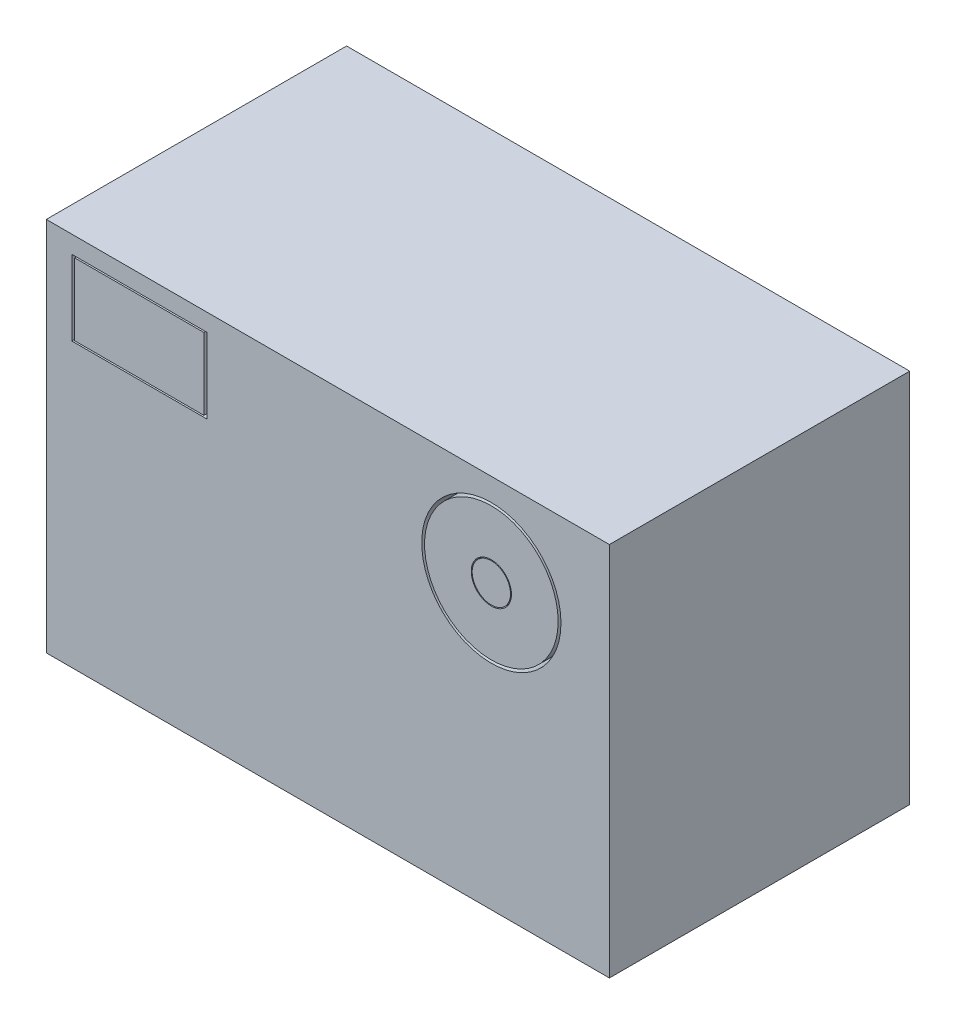
ISO-10303-21;
HEADER;
FILE_DESCRIPTION(('STEP AP214'),'2;1');
FILE_NAME('part.step','',(''),(''),'','','');
FILE_SCHEMA(('AUTOMOTIVE_DESIGN { 1 0 10303 214 1 1 1 1 }'));
ENDSEC;
DATA;
#1=APPLICATION_CONTEXT('core data for automotive mechanical design processes');
#2=APPLICATION_PROTOCOL_DEFINITION('international standard','automotive_design',2000,#1);
#3=PRODUCT_CONTEXT('',#1,'mechanical');
#4=PRODUCT('Part','Part','',(#3));
#5=PRODUCT_RELATED_PRODUCT_CATEGORY('part','',(#4));
#6=PRODUCT_DEFINITION_FORMATION('','',#4);
#7=PRODUCT_DEFINITION_CONTEXT('part definition',#1,'design');
#8=PRODUCT_DEFINITION('design','',#6,#7);
#9=PRODUCT_DEFINITION_SHAPE('','',#8);
#10=(LENGTH_UNIT() NAMED_UNIT(*) SI_UNIT(.MILLI.,.METRE.));
#11=(NAMED_UNIT(*) PLANE_ANGLE_UNIT() SI_UNIT($,.RADIAN.));
#12=(NAMED_UNIT(*) SI_UNIT($,.STERADIAN.) SOLID_ANGLE_UNIT());
#13=UNCERTAINTY_MEASURE_WITH_UNIT(LENGTH_MEASURE(1.E-05),#10,'distance_accuracy_value','');
#14=(GEOMETRIC_REPRESENTATION_CONTEXT(3) GLOBAL_UNCERTAINTY_ASSIGNED_CONTEXT((#13)) GLOBAL_UNIT_ASSIGNED_CONTEXT((#10,
#11,#12)) REPRESENTATION_CONTEXT('',''));
#15=CARTESIAN_POINT('',(0.,0.,0.));
#16=DIRECTION('',(0.,0.,1.));
#17=DIRECTION('',(1.,0.,0.));
#18=AXIS2_PLACEMENT_3D('',#15,#16,#17);
#19=CARTESIAN_POINT('',(37.5,25.,40.));
#20=DIRECTION('',(-1.,0.,0.));
#21=DIRECTION('',(0.,-1.,0.));
#22=AXIS2_PLACEMENT_3D('',#19,#20,#21);
#23=PLANE('',#22);
#24=DIRECTION('',(0.,1.,0.));
#25=VECTOR('',#24,1.);
#26=CARTESIAN_POINT('',(37.5,25.,0.));
#27=LINE('',#26,#25);
#28=CARTESIAN_POINT('',(37.5,-25.,0.));
#29=VERTEX_POINT('',#28);
#30=CARTESIAN_POINT('',(37.5,25.,0.));
#31=VERTEX_POINT('',#30);
#32=EDGE_CURVE('E216',#29,#31,#27,.T.);
#33=ORIENTED_EDGE('',*,*,#32,.T.);
#34=DIRECTION('',(0.,0.,-1.));
#35=VECTOR('',#34,1.);
#36=CARTESIAN_POINT('',(37.5,25.,40.));
#37=LINE('',#36,#35);
#38=CARTESIAN_POINT('',(37.5,25.,40.));
#39=VERTEX_POINT('',#38);
#40=EDGE_CURVE('E41',#39,#31,#37,.T.);
#41=ORIENTED_EDGE('',*,*,#40,.F.);
#42=DIRECTION('',(0.,1.,0.));
#43=VECTOR('',#42,1.);
#44=CARTESIAN_POINT('',(37.5,25.,40.));
#45=LINE('',#44,#43);
#46=CARTESIAN_POINT('',(37.5,-25.,40.));
#47=VERTEX_POINT('',#46);
#48=EDGE_CURVE('E219',#47,#39,#45,.T.);
#49=ORIENTED_EDGE('',*,*,#48,.F.);
#50=DIRECTION('',(0.,0.,-1.));
#51=VECTOR('',#50,1.);
#52=CARTESIAN_POINT('',(37.5,-25.,40.));
#53=LINE('',#52,#51);
#54=EDGE_CURVE('E229',#47,#29,#53,.T.);
#55=ORIENTED_EDGE('',*,*,#54,.T.);
#56=EDGE_LOOP('',(#33,#41,#49,#55));
#57=FACE_BOUND('',#56,.T.);
#58=ADVANCED_FACE('F34',(#57),#23,.F.);
#59=CARTESIAN_POINT('',(-37.5,25.,40.));
#60=DIRECTION('',(0.,-1.,0.));
#61=DIRECTION('',(0.,0.,-1.));
#62=AXIS2_PLACEMENT_3D('',#59,#60,#61);
#63=PLANE('',#62);
#64=DIRECTION('',(-1.,0.,0.));
#65=VECTOR('',#64,1.);
#66=CARTESIAN_POINT('',(-37.5,25.,0.));
#67=LINE('',#66,#65);
#68=CARTESIAN_POINT('',(-37.5,25.,0.));
#69=VERTEX_POINT('',#68);
#70=EDGE_CURVE('E232',#31,#69,#67,.T.);
#71=ORIENTED_EDGE('',*,*,#70,.T.);
#72=DIRECTION('',(0.,0.,-1.));
#73=VECTOR('',#72,1.);
#74=CARTESIAN_POINT('',(-37.5,25.,40.));
#75=LINE('',#74,#73);
#76=CARTESIAN_POINT('',(-37.5,25.,40.));
#77=VERTEX_POINT('',#76);
#78=EDGE_CURVE('E242',#77,#69,#75,.T.);
#79=ORIENTED_EDGE('',*,*,#78,.F.);
#80=DIRECTION('',(-1.,0.,0.));
#81=VECTOR('',#80,1.);
#82=CARTESIAN_POINT('',(-37.5,25.,40.));
#83=LINE('',#82,#81);
#84=EDGE_CURVE('E222',#39,#77,#83,.T.);
#85=ORIENTED_EDGE('',*,*,#84,.F.);
#86=ORIENTED_EDGE('',*,*,#40,.T.);
#87=EDGE_LOOP('',(#71,#79,#85,#86));
#88=FACE_BOUND('',#87,.T.);
#89=ADVANCED_FACE('F247',(#88),#63,.F.);
#90=CARTESIAN_POINT('',(-37.5,25.,40.));
#91=DIRECTION('',(1.,0.,0.));
#92=DIRECTION('',(0.,1.,0.));
#93=AXIS2_PLACEMENT_3D('',#90,#91,#92);
#94=PLANE('',#93);
#95=DIRECTION('',(0.,-1.,0.));
#96=VECTOR('',#95,1.);
#97=CARTESIAN_POINT('',(-37.5,25.,0.));
#98=LINE('',#97,#96);
#99=CARTESIAN_POINT('',(-37.5,-25.,0.));
#100=VERTEX_POINT('',#99);
#101=EDGE_CURVE('E234',#69,#100,#98,.T.);
#102=ORIENTED_EDGE('',*,*,#101,.T.);
#103=DIRECTION('',(0.,0.,-1.));
#104=VECTOR('',#103,1.);
#105=CARTESIAN_POINT('',(-37.5,-25.,40.));
#106=LINE('',#105,#104);
#107=CARTESIAN_POINT('',(-37.5,-25.,40.));
#108=VERTEX_POINT('',#107);
#109=EDGE_CURVE('E239',#108,#100,#106,.T.);
#110=ORIENTED_EDGE('',*,*,#109,.F.);
#111=DIRECTION('',(0.,-1.,0.));
#112=VECTOR('',#111,1.);
#113=CARTESIAN_POINT('',(-37.5,25.,40.));
#114=LINE('',#113,#112);
#115=EDGE_CURVE('E225',#77,#108,#114,.T.);
#116=ORIENTED_EDGE('',*,*,#115,.F.);
#117=ORIENTED_EDGE('',*,*,#78,.T.);
#118=EDGE_LOOP('',(#102,#110,#116,#117));
#119=FACE_BOUND('',#118,.T.);
#120=ADVANCED_FACE('F259',(#119),#94,.F.);
#121=CARTESIAN_POINT('',(-37.5,-25.,40.));
#122=DIRECTION('',(0.,1.,0.));
#123=DIRECTION('',(0.,0.,1.));
#124=AXIS2_PLACEMENT_3D('',#121,#122,#123);
#125=PLANE('',#124);
#126=CARTESIAN_POINT('',(0.,-25.,20.));
#127=DIRECTION('',(0.,-1.,0.));
#128=DIRECTION('',(0.,0.,-1.));
#129=AXIS2_PLACEMENT_3D('',#126,#127,#128);
#130=CIRCLE('',#129,5.);
#131=CARTESIAN_POINT('',(0.,-25.,15.));
#132=VERTEX_POINT('',#131);
#133=EDGE_CURVE('E153',#132,#132,#130,.T.);
#134=ORIENTED_EDGE('',*,*,#133,.F.);
#135=EDGE_LOOP('',(#134));
#136=FACE_BOUND('',#135,.T.);
#137=DIRECTION('',(1.,0.,0.));
#138=VECTOR('',#137,1.);
#139=CARTESIAN_POINT('',(-37.5,-25.,0.));
#140=LINE('',#139,#138);
#141=EDGE_CURVE('E223',#100,#29,#140,.T.);
#142=ORIENTED_EDGE('',*,*,#141,.T.);
#143=ORIENTED_EDGE('',*,*,#54,.F.);
#144=DIRECTION('',(1.,0.,0.));
#145=VECTOR('',#144,1.);
#146=CARTESIAN_POINT('',(-37.5,-25.,40.));
#147=LINE('',#146,#145);
#148=EDGE_CURVE('E227',#108,#47,#147,.T.);
#149=ORIENTED_EDGE('',*,*,#148,.F.);
#150=ORIENTED_EDGE('',*,*,#109,.T.);
#151=EDGE_LOOP('',(#142,#143,#149,#150));
#152=FACE_BOUND('',#151,.T.);
#153=ADVANCED_FACE('F263',(#136,#152),#125,.F.);
#154=CARTESIAN_POINT('',(0.,0.,40.));
#155=DIRECTION('',(0.,0.,1.));
#156=DIRECTION('',(1.,0.,0.));
#157=AXIS2_PLACEMENT_3D('',#154,#155,#156);
#158=PLANE('',#157);
#159=DIRECTION('',(0.,1.,0.));
#160=VECTOR('',#159,1.);
#161=CARTESIAN_POINT('',(-16.1069269045162,12.6743621328923,40.));
#162=LINE('',#161,#160);
#163=CARTESIAN_POINT('',(-16.1069269045162,12.6743621328923,40.));
#164=VERTEX_POINT('',#163);
#165=CARTESIAN_POINT('',(-16.1069269045162,22.6743621328923,40.));
#166=VERTEX_POINT('',#165);
#167=EDGE_CURVE('E48',#164,#166,#162,.T.);
#168=ORIENTED_EDGE('',*,*,#167,.F.);
#169=DIRECTION('',(1.,0.,0.));
#170=VECTOR('',#169,1.);
#171=CARTESIAN_POINT('',(-34.1069269045162,12.6743621328923,40.));
#172=LINE('',#171,#170);
#173=CARTESIAN_POINT('',(-34.1069269045162,12.6743621328923,40.));
#174=VERTEX_POINT('',#173);
#175=EDGE_CURVE('E171',#174,#164,#172,.T.);
#176=ORIENTED_EDGE('',*,*,#175,.F.);
#177=DIRECTION('',(0.,-1.,0.));
#178=VECTOR('',#177,1.);
#179=CARTESIAN_POINT('',(-34.1069269045162,12.6743621328923,40.));
#180=LINE('',#179,#178);
#181=CARTESIAN_POINT('',(-34.1069269045162,22.6743621328923,40.));
#182=VERTEX_POINT('',#181);
#183=EDGE_CURVE('E185',#182,#174,#180,.T.);
#184=ORIENTED_EDGE('',*,*,#183,.F.);
#185=DIRECTION('',(-1.,0.,0.));
#186=VECTOR('',#185,1.);
#187=CARTESIAN_POINT('',(-34.1069269045162,22.6743621328923,40.));
#188=LINE('',#187,#186);
#189=EDGE_CURVE('E182',#166,#182,#188,.T.);
#190=ORIENTED_EDGE('',*,*,#189,.F.);
#191=EDGE_LOOP('',(#168,#176,#184,#190));
#192=FACE_BOUND('',#191,.T.);
#193=CARTESIAN_POINT('',(21.7781929220404,12.7140846947109,40.));
#194=DIRECTION('',(0.,0.,1.));
#195=DIRECTION('',(1.,0.,0.));
#196=AXIS2_PLACEMENT_3D('',#193,#194,#195);
#197=CIRCLE('',#196,9.27298373328783);
#198=CARTESIAN_POINT('',(31.0511766553282,12.7140846947109,40.));
#199=VERTEX_POINT('',#198);
#200=EDGE_CURVE('E210',#199,#199,#197,.T.);
#201=ORIENTED_EDGE('',*,*,#200,.F.);
#202=EDGE_LOOP('',(#201));
#203=FACE_BOUND('',#202,.T.);
#204=ORIENTED_EDGE('',*,*,#48,.T.);
#205=ORIENTED_EDGE('',*,*,#84,.T.);
#206=ORIENTED_EDGE('',*,*,#115,.T.);
#207=ORIENTED_EDGE('',*,*,#148,.T.);
#208=EDGE_LOOP('',(#204,#205,#206,#207));
#209=FACE_BOUND('',#208,.T.);
#210=ADVANCED_FACE('F265',(#192,#203,#209),#158,.T.);
#211=CARTESIAN_POINT('',(0.,0.,0.));
#212=DIRECTION('',(0.,0.,1.));
#213=DIRECTION('',(1.,0.,0.));
#214=AXIS2_PLACEMENT_3D('',#211,#212,#213);
#215=PLANE('',#214);
#216=ORIENTED_EDGE('',*,*,#32,.F.);
#217=ORIENTED_EDGE('',*,*,#141,.F.);
#218=ORIENTED_EDGE('',*,*,#101,.F.);
#219=ORIENTED_EDGE('',*,*,#70,.F.);
#220=EDGE_LOOP('',(#216,#217,#218,#219));
#221=FACE_BOUND('',#220,.T.);
#222=ADVANCED_FACE('F255',(#221),#215,.F.);
#223=CARTESIAN_POINT('',(21.7781929220404,12.7140846947109,26.));
#224=DIRECTION('',(0.,0.,1.));
#225=DIRECTION('',(1.,0.,0.));
#226=AXIS2_PLACEMENT_3D('',#223,#224,#225);
#227=CYLINDRICAL_SURFACE('',#226,9.27298373328783);
#228=CARTESIAN_POINT('',(21.7781929220404,12.7140846947109,26.));
#229=DIRECTION('',(0.,0.,1.));
#230=DIRECTION('',(1.,0.,0.));
#231=AXIS2_PLACEMENT_3D('',#228,#229,#230);
#232=CIRCLE('',#231,9.27298373328783);
#233=CARTESIAN_POINT('',(31.0511766553282,12.7140846947109,26.));
#234=VERTEX_POINT('',#233);
#235=EDGE_CURVE('E213',#234,#234,#232,.T.);
#236=ORIENTED_EDGE('',*,*,#235,.F.);
#237=EDGE_LOOP('',(#236));
#238=FACE_BOUND('',#237,.T.);
#239=ORIENTED_EDGE('',*,*,#200,.T.);
#240=EDGE_LOOP('',(#239));
#241=FACE_BOUND('',#240,.T.);
#242=ADVANCED_FACE('F274',(#238,#241),#227,.F.);
#243=CARTESIAN_POINT('',(21.7781929220404,12.7140846947109,26.));
#244=DIRECTION('',(0.,0.,1.));
#245=DIRECTION('',(1.,0.,0.));
#246=AXIS2_PLACEMENT_3D('',#243,#244,#245);
#247=PLANE('',#246);
#248=CARTESIAN_POINT('',(21.7781929220404,12.7140846947109,26.));
#249=DIRECTION('',(0.,0.,1.));
#250=DIRECTION('',(1.,0.,0.));
#251=AXIS2_PLACEMENT_3D('',#248,#249,#250);
#252=CIRCLE('',#251,8.89567309489849);
#253=CARTESIAN_POINT('',(30.6738660169389,12.7140846947109,26.));
#254=VERTEX_POINT('',#253);
#255=EDGE_CURVE('E206',#254,#254,#252,.T.);
#256=ORIENTED_EDGE('',*,*,#255,.F.);
#257=EDGE_LOOP('',(#256));
#258=FACE_BOUND('',#257,.T.);
#259=ORIENTED_EDGE('',*,*,#235,.T.);
#260=EDGE_LOOP('',(#259));
#261=FACE_BOUND('',#260,.T.);
#262=ADVANCED_FACE('F375',(#258,#261),#247,.T.);
#263=CARTESIAN_POINT('',(21.7781929220404,12.7140846947109,40.));
#264=DIRECTION('',(0.,0.,1.));
#265=DIRECTION('',(1.,0.,0.));
#266=AXIS2_PLACEMENT_3D('',#263,#264,#265);
#267=PLANE('',#266);
#268=CARTESIAN_POINT('',(21.7781929220404,12.7140846947109,40.));
#269=DIRECTION('',(0.,0.,1.));
#270=DIRECTION('',(1.,0.,0.));
#271=AXIS2_PLACEMENT_3D('',#268,#269,#270);
#272=CIRCLE('',#271,8.89567309489849);
#273=CARTESIAN_POINT('',(30.6738660169389,12.7140846947109,40.));
#274=VERTEX_POINT('',#273);
#275=EDGE_CURVE('E207',#274,#274,#272,.T.);
#276=ORIENTED_EDGE('',*,*,#275,.T.);
#277=EDGE_LOOP('',(#276));
#278=FACE_BOUND('',#277,.T.);
#279=CARTESIAN_POINT('',(21.7781929220404,12.7140846947109,40.));
#280=DIRECTION('',(0.,0.,1.));
#281=DIRECTION('',(1.,0.,0.));
#282=AXIS2_PLACEMENT_3D('',#279,#280,#281);
#283=CIRCLE('',#282,2.67664940941278);
#284=CARTESIAN_POINT('',(24.4548423314532,12.7140846947109,40.));
#285=VERTEX_POINT('',#284);
#286=EDGE_CURVE('E201',#285,#285,#283,.T.);
#287=ORIENTED_EDGE('',*,*,#286,.F.);
#288=EDGE_LOOP('',(#287));
#289=FACE_BOUND('',#288,.T.);
#290=ADVANCED_FACE('F372',(#278,#289),#267,.T.);
#291=CARTESIAN_POINT('',(21.7781929220404,12.7140846947109,40.));
#292=DIRECTION('',(0.,0.,-1.));
#293=DIRECTION('',(-1.,0.,0.));
#294=AXIS2_PLACEMENT_3D('',#291,#292,#293);
#295=CYLINDRICAL_SURFACE('',#294,8.89567309489849);
#296=ORIENTED_EDGE('',*,*,#275,.F.);
#297=EDGE_LOOP('',(#296));
#298=FACE_BOUND('',#297,.T.);
#299=ORIENTED_EDGE('',*,*,#255,.T.);
#300=EDGE_LOOP('',(#299));
#301=FACE_BOUND('',#300,.T.);
#302=ADVANCED_FACE('F370',(#298,#301),#295,.T.);
#303=CARTESIAN_POINT('',(21.7781929220404,12.7140846947109,40.));
#304=DIRECTION('',(0.,0.,-1.));
#305=DIRECTION('',(-1.,0.,0.));
#306=AXIS2_PLACEMENT_3D('',#303,#304,#305);
#307=CYLINDRICAL_SURFACE('',#306,2.67664940941278);
#308=ORIENTED_EDGE('',*,*,#286,.T.);
#309=EDGE_LOOP('',(#308));
#310=FACE_BOUND('',#309,.T.);
#311=CARTESIAN_POINT('',(21.7781929220404,12.7140846947109,26.));
#312=DIRECTION('',(0.,0.,1.));
#313=DIRECTION('',(1.,0.,0.));
#314=AXIS2_PLACEMENT_3D('',#311,#312,#313);
#315=CIRCLE('',#314,2.67664940941278);
#316=CARTESIAN_POINT('',(24.4548423314532,12.7140846947109,26.));
#317=VERTEX_POINT('',#316);
#318=EDGE_CURVE('E11',#317,#317,#315,.F.);
#319=ORIENTED_EDGE('',*,*,#318,.T.);
#320=EDGE_LOOP('',(#319));
#321=FACE_BOUND('',#320,.T.);
#322=ADVANCED_FACE('F367',(#310,#321),#307,.F.);
#323=CARTESIAN_POINT('',(21.7781929220404,12.7140846947109,26.));
#324=DIRECTION('',(0.,0.,1.));
#325=DIRECTION('',(1.,0.,0.));
#326=AXIS2_PLACEMENT_3D('',#323,#324,#325);
#327=CIRCLE('',#326,2.55286195596396);
#328=CARTESIAN_POINT('',(24.3310548780044,12.7140846947109,26.));
#329=VERTEX_POINT('',#328);
#330=EDGE_CURVE('E192',#329,#329,#327,.T.);
#331=ORIENTED_EDGE('',*,*,#330,.F.);
#332=EDGE_LOOP('',(#331));
#333=FACE_BOUND('',#332,.T.);
#334=ORIENTED_EDGE('',*,*,#318,.F.);
#335=EDGE_LOOP('',(#334));
#336=FACE_BOUND('',#335,.T.);
#337=ADVANCED_FACE('F365',(#333,#336),#247,.T.);
#338=CARTESIAN_POINT('',(21.7781929220404,12.7140846947109,40.));
#339=DIRECTION('',(0.,0.,-1.));
#340=DIRECTION('',(-1.,0.,0.));
#341=AXIS2_PLACEMENT_3D('',#338,#339,#340);
#342=CYLINDRICAL_SURFACE('',#341,2.55286195596396);
#343=CARTESIAN_POINT('',(21.7781929220404,12.7140846947109,40.));
#344=DIRECTION('',(0.,0.,1.));
#345=DIRECTION('',(1.,0.,0.));
#346=AXIS2_PLACEMENT_3D('',#343,#344,#345);
#347=CIRCLE('',#346,2.55286195596396);
#348=CARTESIAN_POINT('',(24.3310548780044,12.7140846947109,40.));
#349=VERTEX_POINT('',#348);
#350=EDGE_CURVE('E198',#349,#349,#347,.T.);
#351=ORIENTED_EDGE('',*,*,#350,.F.);
#352=EDGE_LOOP('',(#351));
#353=FACE_BOUND('',#352,.T.);
#354=ORIENTED_EDGE('',*,*,#330,.T.);
#355=EDGE_LOOP('',(#354));
#356=FACE_BOUND('',#355,.T.);
#357=ADVANCED_FACE('F361',(#353,#356),#342,.T.);
#358=CARTESIAN_POINT('',(21.7781929220404,12.7140846947109,40.));
#359=DIRECTION('',(0.,0.,1.));
#360=DIRECTION('',(1.,0.,0.));
#361=AXIS2_PLACEMENT_3D('',#358,#359,#360);
#362=PLANE('',#361);
#363=ORIENTED_EDGE('',*,*,#350,.T.);
#364=EDGE_LOOP('',(#363));
#365=FACE_BOUND('',#364,.T.);
#366=ADVANCED_FACE('F358',(#365),#362,.T.);
#367=CARTESIAN_POINT('',(-16.1069269045162,12.6743621328923,33.));
#368=DIRECTION('',(1.,0.,0.));
#369=DIRECTION('',(0.,0.,-1.));
#370=AXIS2_PLACEMENT_3D('',#367,#368,#369);
#371=PLANE('',#370);
#372=ORIENTED_EDGE('',*,*,#167,.T.);
#373=DIRECTION('',(0.,0.,1.));
#374=VECTOR('',#373,1.);
#375=CARTESIAN_POINT('',(-16.1069269045162,22.6743621328923,33.));
#376=LINE('',#375,#374);
#377=CARTESIAN_POINT('',(-16.1069269045162,22.6743621328923,33.));
#378=VERTEX_POINT('',#377);
#379=EDGE_CURVE('E180',#378,#166,#376,.T.);
#380=ORIENTED_EDGE('',*,*,#379,.F.);
#381=DIRECTION('',(0.,1.,0.));
#382=VECTOR('',#381,1.);
#383=CARTESIAN_POINT('',(-16.1069269045162,12.6743621328923,33.));
#384=LINE('',#383,#382);
#385=CARTESIAN_POINT('',(-16.1069269045162,12.6743621328923,33.));
#386=VERTEX_POINT('',#385);
#387=EDGE_CURVE('E167',#386,#378,#384,.T.);
#388=ORIENTED_EDGE('',*,*,#387,.F.);
#389=DIRECTION('',(0.,0.,1.));
#390=VECTOR('',#389,1.);
#391=CARTESIAN_POINT('',(-16.1069269045162,12.6743621328923,33.));
#392=LINE('',#391,#390);
#393=EDGE_CURVE('E190',#386,#164,#392,.T.);
#394=ORIENTED_EDGE('',*,*,#393,.T.);
#395=EDGE_LOOP('',(#372,#380,#388,#394));
#396=FACE_BOUND('',#395,.T.);
#397=ADVANCED_FACE('F348',(#396),#371,.F.);
#398=CARTESIAN_POINT('',(-34.1069269045162,12.6743621328923,33.));
#399=DIRECTION('',(0.,-1.,0.));
#400=DIRECTION('',(0.,0.,-1.));
#401=AXIS2_PLACEMENT_3D('',#398,#399,#400);
#402=PLANE('',#401);
#403=ORIENTED_EDGE('',*,*,#175,.T.);
#404=ORIENTED_EDGE('',*,*,#393,.F.);
#405=DIRECTION('',(1.,0.,0.));
#406=VECTOR('',#405,1.);
#407=CARTESIAN_POINT('',(-34.1069269045162,12.6743621328923,33.));
#408=LINE('',#407,#406);
#409=CARTESIAN_POINT('',(-34.1069269045162,12.6743621328923,33.));
#410=VERTEX_POINT('',#409);
#411=EDGE_CURVE('E177',#410,#386,#408,.T.);
#412=ORIENTED_EDGE('',*,*,#411,.F.);
#413=DIRECTION('',(0.,0.,1.));
#414=VECTOR('',#413,1.);
#415=CARTESIAN_POINT('',(-34.1069269045162,12.6743621328923,33.));
#416=LINE('',#415,#414);
#417=EDGE_CURVE('E193',#410,#174,#416,.T.);
#418=ORIENTED_EDGE('',*,*,#417,.T.);
#419=EDGE_LOOP('',(#403,#404,#412,#418));
#420=FACE_BOUND('',#419,.T.);
#421=ADVANCED_FACE('F344',(#420),#402,.F.);
#422=CARTESIAN_POINT('',(-34.1069269045162,12.6743621328923,33.));
#423=DIRECTION('',(-1.,0.,0.));
#424=DIRECTION('',(0.,0.,1.));
#425=AXIS2_PLACEMENT_3D('',#422,#423,#424);
#426=PLANE('',#425);
#427=ORIENTED_EDGE('',*,*,#183,.T.);
#428=ORIENTED_EDGE('',*,*,#417,.F.);
#429=DIRECTION('',(0.,-1.,0.));
#430=VECTOR('',#429,1.);
#431=CARTESIAN_POINT('',(-34.1069269045162,12.6743621328923,33.));
#432=LINE('',#431,#430);
#433=CARTESIAN_POINT('',(-34.1069269045162,22.6743621328923,33.));
#434=VERTEX_POINT('',#433);
#435=EDGE_CURVE('E174',#434,#410,#432,.T.);
#436=ORIENTED_EDGE('',*,*,#435,.F.);
#437=DIRECTION('',(0.,0.,1.));
#438=VECTOR('',#437,1.);
#439=CARTESIAN_POINT('',(-34.1069269045162,22.6743621328923,33.));
#440=LINE('',#439,#438);
#441=EDGE_CURVE('E195',#434,#182,#440,.T.);
#442=ORIENTED_EDGE('',*,*,#441,.T.);
#443=EDGE_LOOP('',(#427,#428,#436,#442));
#444=FACE_BOUND('',#443,.T.);
#445=ADVANCED_FACE('F347',(#444),#426,.F.);
#446=CARTESIAN_POINT('',(-34.1069269045162,22.6743621328923,33.));
#447=DIRECTION('',(0.,1.,0.));
#448=DIRECTION('',(0.,0.,1.));
#449=AXIS2_PLACEMENT_3D('',#446,#447,#448);
#450=PLANE('',#449);
#451=ORIENTED_EDGE('',*,*,#189,.T.);
#452=ORIENTED_EDGE('',*,*,#441,.F.);
#453=DIRECTION('',(-1.,0.,0.));
#454=VECTOR('',#453,1.);
#455=CARTESIAN_POINT('',(-34.1069269045162,22.6743621328923,33.));
#456=LINE('',#455,#454);
#457=EDGE_CURVE('E170',#378,#434,#456,.T.);
#458=ORIENTED_EDGE('',*,*,#457,.F.);
#459=ORIENTED_EDGE('',*,*,#379,.T.);
#460=EDGE_LOOP('',(#451,#452,#458,#459));
#461=FACE_BOUND('',#460,.T.);
#462=ADVANCED_FACE('F343',(#461),#450,.F.);
#463=CARTESIAN_POINT('',(0.,0.,33.));
#464=DIRECTION('',(0.,0.,-1.));
#465=DIRECTION('',(-1.,0.,0.));
#466=AXIS2_PLACEMENT_3D('',#463,#464,#465);
#467=PLANE('',#466);
#468=DIRECTION('',(0.,1.,0.));
#469=VECTOR('',#468,1.);
#470=CARTESIAN_POINT('',(-16.5010941591219,12.8933439410065,33.));
#471=LINE('',#470,#469);
#472=CARTESIAN_POINT('',(-16.5010941591219,12.8933439410065,33.));
#473=VERTEX_POINT('',#472);
#474=CARTESIAN_POINT('',(-16.5010941591219,22.4553803247781,33.));
#475=VERTEX_POINT('',#474);
#476=EDGE_CURVE('E141',#473,#475,#471,.T.);
#477=ORIENTED_EDGE('',*,*,#476,.F.);
#478=DIRECTION('',(1.,0.,0.));
#479=VECTOR('',#478,1.);
#480=CARTESIAN_POINT('',(-33.7127596499106,12.8933439410065,33.));
#481=LINE('',#480,#479);
#482=CARTESIAN_POINT('',(-33.7127596499106,12.8933439410065,33.));
#483=VERTEX_POINT('',#482);
#484=EDGE_CURVE('E134',#483,#473,#481,.T.);
#485=ORIENTED_EDGE('',*,*,#484,.F.);
#486=DIRECTION('',(0.,-1.,0.));
#487=VECTOR('',#486,1.);
#488=CARTESIAN_POINT('',(-33.7127596499106,12.8933439410065,33.));
#489=LINE('',#488,#487);
#490=CARTESIAN_POINT('',(-33.7127596499106,22.4553803247781,33.));
#491=VERTEX_POINT('',#490);
#492=EDGE_CURVE('E144',#491,#483,#489,.T.);
#493=ORIENTED_EDGE('',*,*,#492,.F.);
#494=DIRECTION('',(-1.,0.,0.));
#495=VECTOR('',#494,1.);
#496=CARTESIAN_POINT('',(-33.7127596499106,22.4553803247781,33.));
#497=LINE('',#496,#495);
#498=EDGE_CURVE('E126',#475,#491,#497,.T.);
#499=ORIENTED_EDGE('',*,*,#498,.F.);
#500=EDGE_LOOP('',(#477,#485,#493,#499));
#501=FACE_BOUND('',#500,.T.);
#502=ORIENTED_EDGE('',*,*,#387,.T.);
#503=ORIENTED_EDGE('',*,*,#457,.T.);
#504=ORIENTED_EDGE('',*,*,#435,.T.);
#505=ORIENTED_EDGE('',*,*,#411,.T.);
#506=EDGE_LOOP('',(#502,#503,#504,#505));
#507=FACE_BOUND('',#506,.T.);
#508=ADVANCED_FACE('F138',(#501,#507),#467,.F.);
#509=CARTESIAN_POINT('',(-16.5010941591219,12.8933439410065,33.));
#510=DIRECTION('',(1.,0.,0.));
#511=DIRECTION('',(0.,0.,-1.));
#512=AXIS2_PLACEMENT_3D('',#509,#510,#511);
#513=PLANE('',#512);
#514=DIRECTION('',(0.,1.,0.));
#515=VECTOR('',#514,1.);
#516=CARTESIAN_POINT('',(-16.5010941591219,12.8933439410065,40.));
#517=LINE('',#516,#515);
#518=CARTESIAN_POINT('',(-16.5010941591219,12.8933439410065,40.));
#519=VERTEX_POINT('',#518);
#520=CARTESIAN_POINT('',(-16.5010941591219,22.4553803247781,40.));
#521=VERTEX_POINT('',#520);
#522=EDGE_CURVE('E158',#519,#521,#517,.T.);
#523=ORIENTED_EDGE('',*,*,#522,.F.);
#524=DIRECTION('',(0.,0.,1.));
#525=VECTOR('',#524,1.);
#526=CARTESIAN_POINT('',(-16.5010941591219,12.8933439410065,33.));
#527=LINE('',#526,#525);
#528=EDGE_CURVE('E147',#473,#519,#527,.T.);
#529=ORIENTED_EDGE('',*,*,#528,.F.);
#530=ORIENTED_EDGE('',*,*,#476,.T.);
#531=DIRECTION('',(0.,0.,1.));
#532=VECTOR('',#531,1.);
#533=CARTESIAN_POINT('',(-16.5010941591219,22.4553803247781,33.));
#534=LINE('',#533,#532);
#535=EDGE_CURVE('E123',#475,#521,#534,.T.);
#536=ORIENTED_EDGE('',*,*,#535,.T.);
#537=EDGE_LOOP('',(#523,#529,#530,#536));
#538=FACE_BOUND('',#537,.T.);
#539=ADVANCED_FACE('F146',(#538),#513,.T.);
#540=CARTESIAN_POINT('',(-33.7127596499106,12.8933439410065,33.));
#541=DIRECTION('',(0.,-1.,0.));
#542=DIRECTION('',(0.,0.,-1.));
#543=AXIS2_PLACEMENT_3D('',#540,#541,#542);
#544=PLANE('',#543);
#545=DIRECTION('',(1.,0.,0.));
#546=VECTOR('',#545,1.);
#547=CARTESIAN_POINT('',(-33.7127596499106,12.8933439410065,40.));
#548=LINE('',#547,#546);
#549=CARTESIAN_POINT('',(-33.7127596499106,12.8933439410065,40.));
#550=VERTEX_POINT('',#549);
#551=EDGE_CURVE('E148',#550,#519,#548,.T.);
#552=ORIENTED_EDGE('',*,*,#551,.F.);
#553=DIRECTION('',(0.,0.,1.));
#554=VECTOR('',#553,1.);
#555=CARTESIAN_POINT('',(-33.7127596499106,12.8933439410065,33.));
#556=LINE('',#555,#554);
#557=EDGE_CURVE('E164',#483,#550,#556,.T.);
#558=ORIENTED_EDGE('',*,*,#557,.F.);
#559=ORIENTED_EDGE('',*,*,#484,.T.);
#560=ORIENTED_EDGE('',*,*,#528,.T.);
#561=EDGE_LOOP('',(#552,#558,#559,#560));
#562=FACE_BOUND('',#561,.T.);
#563=ADVANCED_FACE('F330',(#562),#544,.T.);
#564=CARTESIAN_POINT('',(-33.7127596499106,12.8933439410065,33.));
#565=DIRECTION('',(-1.,0.,0.));
#566=DIRECTION('',(0.,0.,1.));
#567=AXIS2_PLACEMENT_3D('',#564,#565,#566);
#568=PLANE('',#567);
#569=DIRECTION('',(0.,-1.,0.));
#570=VECTOR('',#569,1.);
#571=CARTESIAN_POINT('',(-33.7127596499106,12.8933439410065,40.));
#572=LINE('',#571,#570);
#573=CARTESIAN_POINT('',(-33.7127596499106,22.4553803247781,40.));
#574=VERTEX_POINT('',#573);
#575=EDGE_CURVE('E56',#574,#550,#572,.T.);
#576=ORIENTED_EDGE('',*,*,#575,.F.);
#577=DIRECTION('',(0.,0.,1.));
#578=VECTOR('',#577,1.);
#579=CARTESIAN_POINT('',(-33.7127596499106,22.4553803247781,33.));
#580=LINE('',#579,#578);
#581=EDGE_CURVE('E133',#491,#574,#580,.T.);
#582=ORIENTED_EDGE('',*,*,#581,.F.);
#583=ORIENTED_EDGE('',*,*,#492,.T.);
#584=ORIENTED_EDGE('',*,*,#557,.T.);
#585=EDGE_LOOP('',(#576,#582,#583,#584));
#586=FACE_BOUND('',#585,.T.);
#587=ADVANCED_FACE('F333',(#586),#568,.T.);
#588=CARTESIAN_POINT('',(-33.7127596499106,22.4553803247781,33.));
#589=DIRECTION('',(0.,1.,0.));
#590=DIRECTION('',(0.,0.,1.));
#591=AXIS2_PLACEMENT_3D('',#588,#589,#590);
#592=PLANE('',#591);
#593=DIRECTION('',(-1.,0.,0.));
#594=VECTOR('',#593,1.);
#595=CARTESIAN_POINT('',(-33.7127596499106,22.4553803247781,40.));
#596=LINE('',#595,#594);
#597=EDGE_CURVE('E128',#521,#574,#596,.T.);
#598=ORIENTED_EDGE('',*,*,#597,.F.);
#599=ORIENTED_EDGE('',*,*,#535,.F.);
#600=ORIENTED_EDGE('',*,*,#498,.T.);
#601=ORIENTED_EDGE('',*,*,#581,.T.);
#602=EDGE_LOOP('',(#598,#599,#600,#601));
#603=FACE_BOUND('',#602,.T.);
#604=ADVANCED_FACE('F125',(#603),#592,.T.);
#605=ORIENTED_EDGE('',*,*,#551,.T.);
#606=ORIENTED_EDGE('',*,*,#522,.T.);
#607=ORIENTED_EDGE('',*,*,#597,.T.);
#608=ORIENTED_EDGE('',*,*,#575,.T.);
#609=EDGE_LOOP('',(#605,#606,#607,#608));
#610=FACE_BOUND('',#609,.T.);
#611=ADVANCED_FACE('F269',(#610),#158,.T.);
#612=CARTESIAN_POINT('',(0.,-15.,20.));
#613=DIRECTION('',(0.,-1.,0.));
#614=DIRECTION('',(0.,0.,-1.));
#615=AXIS2_PLACEMENT_3D('',#612,#613,#614);
#616=CYLINDRICAL_SURFACE('',#615,5.);
#617=CARTESIAN_POINT('',(0.,-15.,20.));
#618=DIRECTION('',(0.,-1.,0.));
#619=DIRECTION('',(0.,0.,-1.));
#620=AXIS2_PLACEMENT_3D('',#617,#618,#619);
#621=CIRCLE('',#620,5.);
#622=CARTESIAN_POINT('',(0.,-15.,15.));
#623=VERTEX_POINT('',#622);
#624=EDGE_CURVE('E160',#623,#623,#621,.T.);
#625=ORIENTED_EDGE('',*,*,#624,.F.);
#626=EDGE_LOOP('',(#625));
#627=FACE_BOUND('',#626,.T.);
#628=ORIENTED_EDGE('',*,*,#133,.T.);
#629=EDGE_LOOP('',(#628));
#630=FACE_BOUND('',#629,.T.);
#631=ADVANCED_FACE('F281',(#627,#630),#616,.F.);
#632=CARTESIAN_POINT('',(0.,-15.,20.));
#633=DIRECTION('',(0.,-1.,0.));
#634=DIRECTION('',(0.,0.,-1.));
#635=AXIS2_PLACEMENT_3D('',#632,#633,#634);
#636=PLANE('',#635);
#637=ORIENTED_EDGE('',*,*,#624,.T.);
#638=EDGE_LOOP('',(#637));
#639=FACE_BOUND('',#638,.T.);
#640=ADVANCED_FACE('F313',(#639),#636,.T.);
#641=CLOSED_SHELL('',(#58,#89,#120,#153,#210,#222,#242,#262,#290,#302,#322,#337,#357,#366,#397,
#421,#445,#462,#508,#539,#563,#587,#604,#611,#631,#640));
#642=MANIFOLD_SOLID_BREP('B2',#641);
#643=ADVANCED_BREP_SHAPE_REPRESENTATION('',(#18,#642),#14);
#644=SHAPE_DEFINITION_REPRESENTATION(#9,#643);
ENDSEC;
END-ISO-10303-21;
